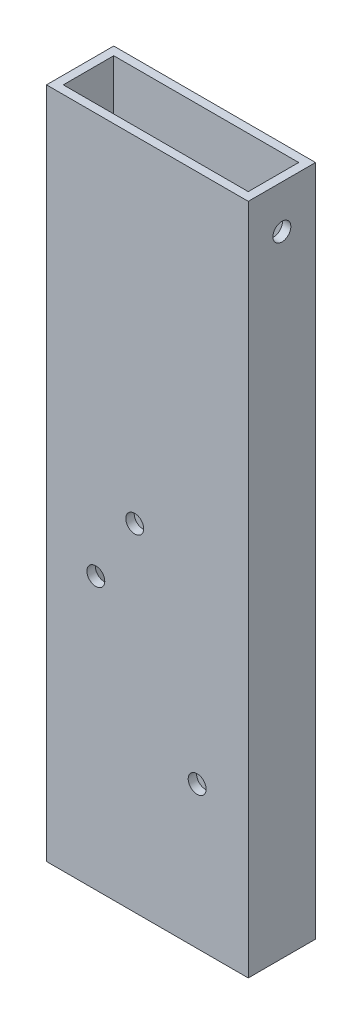
ISO-10303-21;
HEADER;
FILE_DESCRIPTION(('STEP AP214'),'2;1');
FILE_NAME('part.step','',(''),(''),'','','');
FILE_SCHEMA(('AUTOMOTIVE_DESIGN { 1 0 10303 214 1 1 1 1 }'));
ENDSEC;
DATA;
#1=APPLICATION_CONTEXT('core data for automotive mechanical design processes');
#2=APPLICATION_PROTOCOL_DEFINITION('international standard','automotive_design',2000,#1);
#3=PRODUCT_CONTEXT('',#1,'mechanical');
#4=PRODUCT('Part','Part','',(#3));
#5=PRODUCT_RELATED_PRODUCT_CATEGORY('part','',(#4));
#6=PRODUCT_DEFINITION_FORMATION('','',#4);
#7=PRODUCT_DEFINITION_CONTEXT('part definition',#1,'design');
#8=PRODUCT_DEFINITION('design','',#6,#7);
#9=PRODUCT_DEFINITION_SHAPE('','',#8);
#10=(LENGTH_UNIT() NAMED_UNIT(*) SI_UNIT(.MILLI.,.METRE.));
#11=(NAMED_UNIT(*) PLANE_ANGLE_UNIT() SI_UNIT($,.RADIAN.));
#12=(NAMED_UNIT(*) SI_UNIT($,.STERADIAN.) SOLID_ANGLE_UNIT());
#13=UNCERTAINTY_MEASURE_WITH_UNIT(LENGTH_MEASURE(1.E-05),#10,'distance_accuracy_value','');
#14=(GEOMETRIC_REPRESENTATION_CONTEXT(3) GLOBAL_UNCERTAINTY_ASSIGNED_CONTEXT((#13)) GLOBAL_UNIT_ASSIGNED_CONTEXT((#10,
#11,#12)) REPRESENTATION_CONTEXT('',''));
#15=CARTESIAN_POINT('',(0.,0.,0.));
#16=DIRECTION('',(0.,0.,1.));
#17=DIRECTION('',(1.,0.,0.));
#18=AXIS2_PLACEMENT_3D('',#15,#16,#17);
#19=CARTESIAN_POINT('',(0.,254.,0.));
#20=DIRECTION('',(0.,-1.,0.));
#21=DIRECTION('',(0.,0.,-1.));
#22=AXIS2_PLACEMENT_3D('',#19,#20,#21);
#23=PLANE('',#22);
#24=DIRECTION('',(0.,0.,1.));
#25=VECTOR('',#24,1.);
#26=CARTESIAN_POINT('',(0.,254.,0.));
#27=LINE('',#26,#25);
#28=CARTESIAN_POINT('',(0.,254.,-25.4));
#29=VERTEX_POINT('',#28);
#30=CARTESIAN_POINT('',(0.,254.,0.));
#31=VERTEX_POINT('',#30);
#32=EDGE_CURVE('E137',#29,#31,#27,.T.);
#33=ORIENTED_EDGE('',*,*,#32,.T.);
#34=DIRECTION('',(1.,0.,0.));
#35=VECTOR('',#34,1.);
#36=CARTESIAN_POINT('',(0.,254.,0.));
#37=LINE('',#36,#35);
#38=CARTESIAN_POINT('',(76.2,254.,0.));
#39=VERTEX_POINT('',#38);
#40=EDGE_CURVE('E140',#31,#39,#37,.T.);
#41=ORIENTED_EDGE('',*,*,#40,.T.);
#42=DIRECTION('',(0.,0.,-1.));
#43=VECTOR('',#42,1.);
#44=CARTESIAN_POINT('',(76.2,254.,0.));
#45=LINE('',#44,#43);
#46=CARTESIAN_POINT('',(76.2,254.,-25.4));
#47=VERTEX_POINT('',#46);
#48=EDGE_CURVE('E143',#39,#47,#45,.T.);
#49=ORIENTED_EDGE('',*,*,#48,.T.);
#50=DIRECTION('',(-1.,0.,0.));
#51=VECTOR('',#50,1.);
#52=CARTESIAN_POINT('',(0.,254.,-25.4));
#53=LINE('',#52,#51);
#54=EDGE_CURVE('E145',#47,#29,#53,.T.);
#55=ORIENTED_EDGE('',*,*,#54,.T.);
#56=EDGE_LOOP('',(#33,#41,#49,#55));
#57=FACE_BOUND('',#56,.T.);
#58=DIRECTION('',(0.,0.,1.));
#59=VECTOR('',#58,1.);
#60=CARTESIAN_POINT('',(3.175,254.,-3.175));
#61=LINE('',#60,#59);
#62=CARTESIAN_POINT('',(3.175,254.,-22.225));
#63=VERTEX_POINT('',#62);
#64=CARTESIAN_POINT('',(3.175,254.,-3.175));
#65=VERTEX_POINT('',#64);
#66=EDGE_CURVE('E99',#63,#65,#61,.T.);
#67=ORIENTED_EDGE('',*,*,#66,.F.);
#68=DIRECTION('',(-1.,0.,0.));
#69=VECTOR('',#68,1.);
#70=CARTESIAN_POINT('',(3.175,254.,-22.225));
#71=LINE('',#70,#69);
#72=CARTESIAN_POINT('',(73.025,254.,-22.225));
#73=VERTEX_POINT('',#72);
#74=EDGE_CURVE('E121',#73,#63,#71,.T.);
#75=ORIENTED_EDGE('',*,*,#74,.F.);
#76=DIRECTION('',(0.,0.,-1.));
#77=VECTOR('',#76,1.);
#78=CARTESIAN_POINT('',(73.025,254.,-3.175));
#79=LINE('',#78,#77);
#80=CARTESIAN_POINT('',(73.025,254.,-3.175));
#81=VERTEX_POINT('',#80);
#82=EDGE_CURVE('E119',#81,#73,#79,.T.);
#83=ORIENTED_EDGE('',*,*,#82,.F.);
#84=DIRECTION('',(1.,0.,0.));
#85=VECTOR('',#84,1.);
#86=CARTESIAN_POINT('',(3.175,254.,-3.175));
#87=LINE('',#86,#85);
#88=EDGE_CURVE('E107',#65,#81,#87,.T.);
#89=ORIENTED_EDGE('',*,*,#88,.F.);
#90=EDGE_LOOP('',(#67,#75,#83,#89));
#91=FACE_BOUND('',#90,.T.);
#92=ADVANCED_FACE('F32',(#57,#91),#23,.F.);
#93=CARTESIAN_POINT('',(0.,0.,0.));
#94=DIRECTION('',(0.,-1.,0.));
#95=DIRECTION('',(0.,0.,-1.));
#96=AXIS2_PLACEMENT_3D('',#93,#94,#95);
#97=PLANE('',#96);
#98=DIRECTION('',(0.,0.,1.));
#99=VECTOR('',#98,1.);
#100=CARTESIAN_POINT('',(0.,0.,0.));
#101=LINE('',#100,#99);
#102=CARTESIAN_POINT('',(0.,0.,-25.4));
#103=VERTEX_POINT('',#102);
#104=CARTESIAN_POINT('',(0.,0.,0.));
#105=VERTEX_POINT('',#104);
#106=EDGE_CURVE('E115',#103,#105,#101,.T.);
#107=ORIENTED_EDGE('',*,*,#106,.F.);
#108=DIRECTION('',(-1.,0.,0.));
#109=VECTOR('',#108,1.);
#110=CARTESIAN_POINT('',(0.,0.,-25.4));
#111=LINE('',#110,#109);
#112=CARTESIAN_POINT('',(76.2,0.,-25.4));
#113=VERTEX_POINT('',#112);
#114=EDGE_CURVE('E141',#113,#103,#111,.T.);
#115=ORIENTED_EDGE('',*,*,#114,.F.);
#116=DIRECTION('',(0.,0.,-1.));
#117=VECTOR('',#116,1.);
#118=CARTESIAN_POINT('',(76.2,0.,0.));
#119=LINE('',#118,#117);
#120=CARTESIAN_POINT('',(76.2,0.,0.));
#121=VERTEX_POINT('',#120);
#122=EDGE_CURVE('E152',#121,#113,#119,.T.);
#123=ORIENTED_EDGE('',*,*,#122,.F.);
#124=DIRECTION('',(1.,0.,0.));
#125=VECTOR('',#124,1.);
#126=CARTESIAN_POINT('',(0.,0.,0.));
#127=LINE('',#126,#125);
#128=EDGE_CURVE('E150',#105,#121,#127,.T.);
#129=ORIENTED_EDGE('',*,*,#128,.F.);
#130=EDGE_LOOP('',(#107,#115,#123,#129));
#131=FACE_BOUND('',#130,.T.);
#132=DIRECTION('',(-1.,0.,0.));
#133=VECTOR('',#132,1.);
#134=CARTESIAN_POINT('',(3.175,0.,-22.225));
#135=LINE('',#134,#133);
#136=CARTESIAN_POINT('',(73.025,0.,-22.225));
#137=VERTEX_POINT('',#136);
#138=CARTESIAN_POINT('',(3.175,0.,-22.225));
#139=VERTEX_POINT('',#138);
#140=EDGE_CURVE('E108',#137,#139,#135,.T.);
#141=ORIENTED_EDGE('',*,*,#140,.T.);
#142=DIRECTION('',(0.,0.,1.));
#143=VECTOR('',#142,1.);
#144=CARTESIAN_POINT('',(3.175,0.,-3.175));
#145=LINE('',#144,#143);
#146=CARTESIAN_POINT('',(3.175,0.,-3.175));
#147=VERTEX_POINT('',#146);
#148=EDGE_CURVE('E57',#139,#147,#145,.T.);
#149=ORIENTED_EDGE('',*,*,#148,.T.);
#150=DIRECTION('',(1.,0.,0.));
#151=VECTOR('',#150,1.);
#152=CARTESIAN_POINT('',(3.175,0.,-3.175));
#153=LINE('',#152,#151);
#154=CARTESIAN_POINT('',(73.025,0.,-3.175));
#155=VERTEX_POINT('',#154);
#156=EDGE_CURVE('E114',#147,#155,#153,.T.);
#157=ORIENTED_EDGE('',*,*,#156,.T.);
#158=DIRECTION('',(0.,0.,-1.));
#159=VECTOR('',#158,1.);
#160=CARTESIAN_POINT('',(73.025,0.,-3.175));
#161=LINE('',#160,#159);
#162=EDGE_CURVE('E129',#155,#137,#161,.T.);
#163=ORIENTED_EDGE('',*,*,#162,.T.);
#164=EDGE_LOOP('',(#141,#149,#157,#163));
#165=FACE_BOUND('',#164,.T.);
#166=ADVANCED_FACE('F212',(#131,#165),#97,.T.);
#167=CARTESIAN_POINT('',(0.,254.,0.));
#168=DIRECTION('',(1.,0.,0.));
#169=DIRECTION('',(0.,0.,-1.));
#170=AXIS2_PLACEMENT_3D('',#167,#168,#169);
#171=PLANE('',#170);
#172=CARTESIAN_POINT('',(0.,237.7313,-12.6999999999999));
#173=DIRECTION('',(1.,0.,0.));
#174=DIRECTION('',(0.,0.,-1.));
#175=AXIS2_PLACEMENT_3D('',#172,#173,#174);
#176=CIRCLE('',#175,3.37819999999999);
#177=CARTESIAN_POINT('',(0.,237.7313,-16.0781999999999));
#178=VERTEX_POINT('',#177);
#179=EDGE_CURVE('E299',#178,#178,#176,.T.);
#180=ORIENTED_EDGE('',*,*,#179,.T.);
#181=EDGE_LOOP('',(#180));
#182=FACE_BOUND('',#181,.T.);
#183=ORIENTED_EDGE('',*,*,#106,.T.);
#184=DIRECTION('',(0.,-1.,0.));
#185=VECTOR('',#184,1.);
#186=CARTESIAN_POINT('',(0.,254.,0.));
#187=LINE('',#186,#185);
#188=EDGE_CURVE('E11',#31,#105,#187,.T.);
#189=ORIENTED_EDGE('',*,*,#188,.F.);
#190=ORIENTED_EDGE('',*,*,#32,.F.);
#191=DIRECTION('',(0.,-1.,0.));
#192=VECTOR('',#191,1.);
#193=CARTESIAN_POINT('',(0.,254.,-25.4));
#194=LINE('',#193,#192);
#195=EDGE_CURVE('E147',#29,#103,#194,.T.);
#196=ORIENTED_EDGE('',*,*,#195,.T.);
#197=EDGE_LOOP('',(#183,#189,#190,#196));
#198=FACE_BOUND('',#197,.T.);
#199=ADVANCED_FACE('F34',(#182,#198),#171,.F.);
#200=CARTESIAN_POINT('',(0.,254.,0.));
#201=DIRECTION('',(0.,0.,-1.));
#202=DIRECTION('',(-1.,0.,0.));
#203=AXIS2_PLACEMENT_3D('',#200,#201,#202);
#204=PLANE('',#203);
#205=CARTESIAN_POINT('',(18.6364311194577,102.638247628737,0.));
#206=DIRECTION('',(0.,0.,1.));
#207=DIRECTION('',(1.,0.,0.));
#208=AXIS2_PLACEMENT_3D('',#205,#206,#207);
#209=CIRCLE('',#208,3.3782);
#210=CARTESIAN_POINT('',(22.0146311194577,102.638247628737,0.));
#211=VERTEX_POINT('',#210);
#212=EDGE_CURVE('E237',#211,#211,#209,.T.);
#213=ORIENTED_EDGE('',*,*,#212,.F.);
#214=EDGE_LOOP('',(#213));
#215=FACE_BOUND('',#214,.T.);
#216=CARTESIAN_POINT('',(33.330604717564,127.145631970375,0.));
#217=DIRECTION('',(0.,0.,1.));
#218=DIRECTION('',(1.,0.,0.));
#219=AXIS2_PLACEMENT_3D('',#216,#217,#218);
#220=CIRCLE('',#219,3.37819999999999);
#221=CARTESIAN_POINT('',(36.708804717564,127.145631970375,0.));
#222=VERTEX_POINT('',#221);
#223=EDGE_CURVE('E183',#222,#222,#220,.T.);
#224=ORIENTED_EDGE('',*,*,#223,.F.);
#225=EDGE_LOOP('',(#224));
#226=FACE_BOUND('',#225,.T.);
#227=CARTESIAN_POINT('',(56.8977127060624,53.7836953832153,0.));
#228=DIRECTION('',(0.,0.,1.));
#229=DIRECTION('',(1.,0.,0.));
#230=AXIS2_PLACEMENT_3D('',#227,#228,#229);
#231=CIRCLE('',#230,3.37819999999999);
#232=CARTESIAN_POINT('',(60.2759127060624,53.7836953832153,0.));
#233=VERTEX_POINT('',#232);
#234=EDGE_CURVE('E176',#233,#233,#231,.T.);
#235=ORIENTED_EDGE('',*,*,#234,.F.);
#236=EDGE_LOOP('',(#235));
#237=FACE_BOUND('',#236,.T.);
#238=ORIENTED_EDGE('',*,*,#128,.T.);
#239=DIRECTION('',(0.,-1.,0.));
#240=VECTOR('',#239,1.);
#241=CARTESIAN_POINT('',(76.2,254.,0.));
#242=LINE('',#241,#240);
#243=EDGE_CURVE('E41',#39,#121,#242,.T.);
#244=ORIENTED_EDGE('',*,*,#243,.F.);
#245=ORIENTED_EDGE('',*,*,#40,.F.);
#246=ORIENTED_EDGE('',*,*,#188,.T.);
#247=EDGE_LOOP('',(#238,#244,#245,#246));
#248=FACE_BOUND('',#247,.T.);
#249=ADVANCED_FACE('F226',(#215,#226,#237,#248),#204,.F.);
#250=CARTESIAN_POINT('',(76.2,254.,0.));
#251=DIRECTION('',(-1.,0.,0.));
#252=DIRECTION('',(0.,0.,1.));
#253=AXIS2_PLACEMENT_3D('',#250,#251,#252);
#254=PLANE('',#253);
#255=CARTESIAN_POINT('',(76.2,237.7313,-12.6999999999999));
#256=DIRECTION('',(-1.,0.,0.));
#257=DIRECTION('',(0.,0.,1.));
#258=AXIS2_PLACEMENT_3D('',#255,#256,#257);
#259=CIRCLE('',#258,3.37819999999999);
#260=CARTESIAN_POINT('',(76.2,237.7313,-9.32179999999988));
#261=VERTEX_POINT('',#260);
#262=EDGE_CURVE('E293',#261,#261,#259,.T.);
#263=ORIENTED_EDGE('',*,*,#262,.T.);
#264=EDGE_LOOP('',(#263));
#265=FACE_BOUND('',#264,.T.);
#266=ORIENTED_EDGE('',*,*,#122,.T.);
#267=DIRECTION('',(0.,-1.,0.));
#268=VECTOR('',#267,1.);
#269=CARTESIAN_POINT('',(76.2,254.,-25.4));
#270=LINE('',#269,#268);
#271=EDGE_CURVE('E157',#47,#113,#270,.T.);
#272=ORIENTED_EDGE('',*,*,#271,.F.);
#273=ORIENTED_EDGE('',*,*,#48,.F.);
#274=ORIENTED_EDGE('',*,*,#243,.T.);
#275=EDGE_LOOP('',(#266,#272,#273,#274));
#276=FACE_BOUND('',#275,.T.);
#277=ADVANCED_FACE('F223',(#265,#276),#254,.F.);
#278=CARTESIAN_POINT('',(0.,254.,-25.4));
#279=DIRECTION('',(0.,0.,1.));
#280=DIRECTION('',(1.,0.,0.));
#281=AXIS2_PLACEMENT_3D('',#278,#279,#280);
#282=PLANE('',#281);
#283=CARTESIAN_POINT('',(18.6364311194577,102.638247628737,-25.4));
#284=DIRECTION('',(0.,0.,1.));
#285=DIRECTION('',(1.,0.,0.));
#286=AXIS2_PLACEMENT_3D('',#283,#284,#285);
#287=CIRCLE('',#286,3.3782);
#288=CARTESIAN_POINT('',(22.0146311194577,102.638247628737,-25.4));
#289=VERTEX_POINT('',#288);
#290=EDGE_CURVE('E169',#289,#289,#287,.T.);
#291=ORIENTED_EDGE('',*,*,#290,.T.);
#292=EDGE_LOOP('',(#291));
#293=FACE_BOUND('',#292,.T.);
#294=CARTESIAN_POINT('',(33.330604717564,127.145631970375,-25.4));
#295=DIRECTION('',(0.,0.,1.));
#296=DIRECTION('',(1.,0.,0.));
#297=AXIS2_PLACEMENT_3D('',#294,#295,#296);
#298=CIRCLE('',#297,3.37819999999999);
#299=CARTESIAN_POINT('',(36.708804717564,127.145631970375,-25.4));
#300=VERTEX_POINT('',#299);
#301=EDGE_CURVE('E304',#300,#300,#298,.T.);
#302=ORIENTED_EDGE('',*,*,#301,.T.);
#303=EDGE_LOOP('',(#302));
#304=FACE_BOUND('',#303,.T.);
#305=CARTESIAN_POINT('',(56.8977127060624,53.7836953832153,-25.4));
#306=DIRECTION('',(0.,0.,1.));
#307=DIRECTION('',(1.,0.,0.));
#308=AXIS2_PLACEMENT_3D('',#305,#306,#307);
#309=CIRCLE('',#308,3.37819999999999);
#310=CARTESIAN_POINT('',(60.2759127060624,53.7836953832153,-25.4));
#311=VERTEX_POINT('',#310);
#312=EDGE_CURVE('E165',#311,#311,#309,.T.);
#313=ORIENTED_EDGE('',*,*,#312,.T.);
#314=EDGE_LOOP('',(#313));
#315=FACE_BOUND('',#314,.T.);
#316=ORIENTED_EDGE('',*,*,#114,.T.);
#317=ORIENTED_EDGE('',*,*,#195,.F.);
#318=ORIENTED_EDGE('',*,*,#54,.F.);
#319=ORIENTED_EDGE('',*,*,#271,.T.);
#320=EDGE_LOOP('',(#316,#317,#318,#319));
#321=FACE_BOUND('',#320,.T.);
#322=ADVANCED_FACE('F206',(#293,#304,#315,#321),#282,.F.);
#323=CARTESIAN_POINT('',(3.175,254.,-3.175));
#324=DIRECTION('',(1.,0.,0.));
#325=DIRECTION('',(0.,0.,-1.));
#326=AXIS2_PLACEMENT_3D('',#323,#324,#325);
#327=PLANE('',#326);
#328=CARTESIAN_POINT('',(3.175,237.7313,-12.6999999999999));
#329=DIRECTION('',(1.,0.,0.));
#330=DIRECTION('',(0.,0.,-1.));
#331=AXIS2_PLACEMENT_3D('',#328,#329,#330);
#332=CIRCLE('',#331,3.37819999999999);
#333=CARTESIAN_POINT('',(3.175,237.7313,-16.0781999999999));
#334=VERTEX_POINT('',#333);
#335=EDGE_CURVE('E295',#334,#334,#332,.T.);
#336=ORIENTED_EDGE('',*,*,#335,.F.);
#337=EDGE_LOOP('',(#336));
#338=FACE_BOUND('',#337,.T.);
#339=ORIENTED_EDGE('',*,*,#148,.F.);
#340=DIRECTION('',(0.,-1.,0.));
#341=VECTOR('',#340,1.);
#342=CARTESIAN_POINT('',(3.175,254.,-22.225));
#343=LINE('',#342,#341);
#344=EDGE_CURVE('E103',#63,#139,#343,.T.);
#345=ORIENTED_EDGE('',*,*,#344,.F.);
#346=ORIENTED_EDGE('',*,*,#66,.T.);
#347=DIRECTION('',(0.,-1.,0.));
#348=VECTOR('',#347,1.);
#349=CARTESIAN_POINT('',(3.175,254.,-3.175));
#350=LINE('',#349,#348);
#351=EDGE_CURVE('E102',#65,#147,#350,.T.);
#352=ORIENTED_EDGE('',*,*,#351,.T.);
#353=EDGE_LOOP('',(#339,#345,#346,#352));
#354=FACE_BOUND('',#353,.T.);
#355=ADVANCED_FACE('F101',(#338,#354),#327,.T.);
#356=CARTESIAN_POINT('',(3.175,254.,-3.175));
#357=DIRECTION('',(0.,0.,-1.));
#358=DIRECTION('',(-1.,0.,0.));
#359=AXIS2_PLACEMENT_3D('',#356,#357,#358);
#360=PLANE('',#359);
#361=CARTESIAN_POINT('',(18.6364311194577,102.638247628737,-3.175));
#362=DIRECTION('',(0.,0.,-1.));
#363=DIRECTION('',(-1.,0.,0.));
#364=AXIS2_PLACEMENT_3D('',#361,#362,#363);
#365=CIRCLE('',#364,3.3782);
#366=CARTESIAN_POINT('',(15.2582311194577,102.638247628737,-3.175));
#367=VERTEX_POINT('',#366);
#368=EDGE_CURVE('E172',#367,#367,#365,.T.);
#369=ORIENTED_EDGE('',*,*,#368,.F.);
#370=EDGE_LOOP('',(#369));
#371=FACE_BOUND('',#370,.T.);
#372=CARTESIAN_POINT('',(33.330604717564,127.145631970375,-3.175));
#373=DIRECTION('',(0.,0.,-1.));
#374=DIRECTION('',(-1.,0.,0.));
#375=AXIS2_PLACEMENT_3D('',#372,#373,#374);
#376=CIRCLE('',#375,3.37819999999999);
#377=CARTESIAN_POINT('',(29.952404717564,127.145631970375,-3.175));
#378=VERTEX_POINT('',#377);
#379=EDGE_CURVE('E168',#378,#378,#376,.T.);
#380=ORIENTED_EDGE('',*,*,#379,.F.);
#381=EDGE_LOOP('',(#380));
#382=FACE_BOUND('',#381,.T.);
#383=CARTESIAN_POINT('',(56.8977127060624,53.7836953832153,-3.175));
#384=DIRECTION('',(0.,0.,-1.));
#385=DIRECTION('',(-1.,0.,0.));
#386=AXIS2_PLACEMENT_3D('',#383,#384,#385);
#387=CIRCLE('',#386,3.37819999999999);
#388=CARTESIAN_POINT('',(53.5195127060624,53.7836953832153,-3.175));
#389=VERTEX_POINT('',#388);
#390=EDGE_CURVE('E127',#389,#389,#387,.T.);
#391=ORIENTED_EDGE('',*,*,#390,.F.);
#392=EDGE_LOOP('',(#391));
#393=FACE_BOUND('',#392,.T.);
#394=ORIENTED_EDGE('',*,*,#156,.F.);
#395=ORIENTED_EDGE('',*,*,#351,.F.);
#396=ORIENTED_EDGE('',*,*,#88,.T.);
#397=DIRECTION('',(0.,-1.,0.));
#398=VECTOR('',#397,1.);
#399=CARTESIAN_POINT('',(73.025,254.,-3.175));
#400=LINE('',#399,#398);
#401=EDGE_CURVE('E116',#81,#155,#400,.T.);
#402=ORIENTED_EDGE('',*,*,#401,.T.);
#403=EDGE_LOOP('',(#394,#395,#396,#402));
#404=FACE_BOUND('',#403,.T.);
#405=ADVANCED_FACE('F111',(#371,#382,#393,#404),#360,.T.);
#406=CARTESIAN_POINT('',(73.025,254.,-3.175));
#407=DIRECTION('',(-1.,0.,0.));
#408=DIRECTION('',(0.,0.,1.));
#409=AXIS2_PLACEMENT_3D('',#406,#407,#408);
#410=PLANE('',#409);
#411=CARTESIAN_POINT('',(73.025,237.7313,-12.6999999999999));
#412=DIRECTION('',(-1.,0.,0.));
#413=DIRECTION('',(0.,0.,1.));
#414=AXIS2_PLACEMENT_3D('',#411,#412,#413);
#415=CIRCLE('',#414,3.37819999999999);
#416=CARTESIAN_POINT('',(73.025,237.7313,-9.32179999999988));
#417=VERTEX_POINT('',#416);
#418=EDGE_CURVE('E36',#417,#417,#415,.T.);
#419=ORIENTED_EDGE('',*,*,#418,.F.);
#420=EDGE_LOOP('',(#419));
#421=FACE_BOUND('',#420,.T.);
#422=ORIENTED_EDGE('',*,*,#162,.F.);
#423=ORIENTED_EDGE('',*,*,#401,.F.);
#424=ORIENTED_EDGE('',*,*,#82,.T.);
#425=DIRECTION('',(0.,-1.,0.));
#426=VECTOR('',#425,1.);
#427=CARTESIAN_POINT('',(73.025,254.,-22.225));
#428=LINE('',#427,#426);
#429=EDGE_CURVE('E49',#73,#137,#428,.T.);
#430=ORIENTED_EDGE('',*,*,#429,.T.);
#431=EDGE_LOOP('',(#422,#423,#424,#430));
#432=FACE_BOUND('',#431,.T.);
#433=ADVANCED_FACE('F196',(#421,#432),#410,.T.);
#434=CARTESIAN_POINT('',(3.175,254.,-22.225));
#435=DIRECTION('',(0.,0.,1.));
#436=DIRECTION('',(1.,0.,0.));
#437=AXIS2_PLACEMENT_3D('',#434,#435,#436);
#438=PLANE('',#437);
#439=CARTESIAN_POINT('',(18.6364311194577,102.638247628737,-22.225));
#440=DIRECTION('',(0.,0.,1.));
#441=DIRECTION('',(1.,0.,0.));
#442=AXIS2_PLACEMENT_3D('',#439,#440,#441);
#443=CIRCLE('',#442,3.3782);
#444=CARTESIAN_POINT('',(22.0146311194577,102.638247628737,-22.225));
#445=VERTEX_POINT('',#444);
#446=EDGE_CURVE('E170',#445,#445,#443,.T.);
#447=ORIENTED_EDGE('',*,*,#446,.F.);
#448=EDGE_LOOP('',(#447));
#449=FACE_BOUND('',#448,.T.);
#450=CARTESIAN_POINT('',(33.330604717564,127.145631970375,-22.225));
#451=DIRECTION('',(0.,0.,1.));
#452=DIRECTION('',(1.,0.,0.));
#453=AXIS2_PLACEMENT_3D('',#450,#451,#452);
#454=CIRCLE('',#453,3.37819999999999);
#455=CARTESIAN_POINT('',(36.708804717564,127.145631970375,-22.225));
#456=VERTEX_POINT('',#455);
#457=EDGE_CURVE('E166',#456,#456,#454,.T.);
#458=ORIENTED_EDGE('',*,*,#457,.F.);
#459=EDGE_LOOP('',(#458));
#460=FACE_BOUND('',#459,.T.);
#461=CARTESIAN_POINT('',(56.8977127060624,53.7836953832153,-22.225));
#462=DIRECTION('',(0.,0.,1.));
#463=DIRECTION('',(1.,0.,0.));
#464=AXIS2_PLACEMENT_3D('',#461,#462,#463);
#465=CIRCLE('',#464,3.37819999999999);
#466=CARTESIAN_POINT('',(60.2759127060624,53.7836953832153,-22.225));
#467=VERTEX_POINT('',#466);
#468=EDGE_CURVE('E162',#467,#467,#465,.T.);
#469=ORIENTED_EDGE('',*,*,#468,.F.);
#470=EDGE_LOOP('',(#469));
#471=FACE_BOUND('',#470,.T.);
#472=ORIENTED_EDGE('',*,*,#140,.F.);
#473=ORIENTED_EDGE('',*,*,#429,.F.);
#474=ORIENTED_EDGE('',*,*,#74,.T.);
#475=ORIENTED_EDGE('',*,*,#344,.T.);
#476=EDGE_LOOP('',(#472,#473,#474,#475));
#477=FACE_BOUND('',#476,.T.);
#478=ADVANCED_FACE('F203',(#449,#460,#471,#477),#438,.T.);
#479=CARTESIAN_POINT('',(56.8977127060624,53.7836953832153,-25.4));
#480=DIRECTION('',(0.,0.,1.));
#481=DIRECTION('',(1.,0.,0.));
#482=AXIS2_PLACEMENT_3D('',#479,#480,#481);
#483=CYLINDRICAL_SURFACE('',#482,3.37819999999999);
#484=ORIENTED_EDGE('',*,*,#468,.T.);
#485=EDGE_LOOP('',(#484));
#486=FACE_BOUND('',#485,.T.);
#487=ORIENTED_EDGE('',*,*,#312,.F.);
#488=EDGE_LOOP('',(#487));
#489=FACE_BOUND('',#488,.T.);
#490=ADVANCED_FACE('F259',(#486,#489),#483,.F.);
#491=ORIENTED_EDGE('',*,*,#390,.T.);
#492=EDGE_LOOP('',(#491));
#493=FACE_BOUND('',#492,.T.);
#494=ORIENTED_EDGE('',*,*,#234,.T.);
#495=EDGE_LOOP('',(#494));
#496=FACE_BOUND('',#495,.T.);
#497=ADVANCED_FACE('F192',(#493,#496),#483,.F.);
#498=CARTESIAN_POINT('',(33.330604717564,127.145631970375,-25.4));
#499=DIRECTION('',(0.,0.,1.));
#500=DIRECTION('',(1.,0.,0.));
#501=AXIS2_PLACEMENT_3D('',#498,#499,#500);
#502=CYLINDRICAL_SURFACE('',#501,3.37819999999999);
#503=ORIENTED_EDGE('',*,*,#457,.T.);
#504=EDGE_LOOP('',(#503));
#505=FACE_BOUND('',#504,.T.);
#506=ORIENTED_EDGE('',*,*,#301,.F.);
#507=EDGE_LOOP('',(#506));
#508=FACE_BOUND('',#507,.T.);
#509=ADVANCED_FACE('F269',(#505,#508),#502,.F.);
#510=CARTESIAN_POINT('',(18.6364311194577,102.638247628737,-25.4));
#511=DIRECTION('',(0.,0.,1.));
#512=DIRECTION('',(1.,0.,0.));
#513=AXIS2_PLACEMENT_3D('',#510,#511,#512);
#514=CYLINDRICAL_SURFACE('',#513,3.3782);
#515=ORIENTED_EDGE('',*,*,#446,.T.);
#516=EDGE_LOOP('',(#515));
#517=FACE_BOUND('',#516,.T.);
#518=ORIENTED_EDGE('',*,*,#290,.F.);
#519=EDGE_LOOP('',(#518));
#520=FACE_BOUND('',#519,.T.);
#521=ADVANCED_FACE('F272',(#517,#520),#514,.F.);
#522=ORIENTED_EDGE('',*,*,#379,.T.);
#523=EDGE_LOOP('',(#522));
#524=FACE_BOUND('',#523,.T.);
#525=ORIENTED_EDGE('',*,*,#223,.T.);
#526=EDGE_LOOP('',(#525));
#527=FACE_BOUND('',#526,.T.);
#528=ADVANCED_FACE('F274',(#524,#527),#502,.F.);
#529=ORIENTED_EDGE('',*,*,#368,.T.);
#530=EDGE_LOOP('',(#529));
#531=FACE_BOUND('',#530,.T.);
#532=ORIENTED_EDGE('',*,*,#212,.T.);
#533=EDGE_LOOP('',(#532));
#534=FACE_BOUND('',#533,.T.);
#535=ADVANCED_FACE('F277',(#531,#534),#514,.F.);
#536=CARTESIAN_POINT('',(76.2,237.7313,-12.6999999999999));
#537=DIRECTION('',(-1.,0.,0.));
#538=DIRECTION('',(0.,0.,1.));
#539=AXIS2_PLACEMENT_3D('',#536,#537,#538);
#540=CYLINDRICAL_SURFACE('',#539,3.37819999999999);
#541=ORIENTED_EDGE('',*,*,#418,.T.);
#542=EDGE_LOOP('',(#541));
#543=FACE_BOUND('',#542,.T.);
#544=ORIENTED_EDGE('',*,*,#262,.F.);
#545=EDGE_LOOP('',(#544));
#546=FACE_BOUND('',#545,.T.);
#547=ADVANCED_FACE('F278',(#543,#546),#540,.F.);
#548=ORIENTED_EDGE('',*,*,#335,.T.);
#549=EDGE_LOOP('',(#548));
#550=FACE_BOUND('',#549,.T.);
#551=ORIENTED_EDGE('',*,*,#179,.F.);
#552=EDGE_LOOP('',(#551));
#553=FACE_BOUND('',#552,.T.);
#554=ADVANCED_FACE('F280',(#550,#553),#540,.F.);
#555=CLOSED_SHELL('',(#92,#166,#199,#249,#277,#322,#355,#405,#433,#478,#490,#497,#509,#521,#528,
#535,#547,#554));
#556=MANIFOLD_SOLID_BREP('B2',#555);
#557=ADVANCED_BREP_SHAPE_REPRESENTATION('',(#18,#556),#14);
#558=SHAPE_DEFINITION_REPRESENTATION(#9,#557);
ENDSEC;
END-ISO-10303-21;
